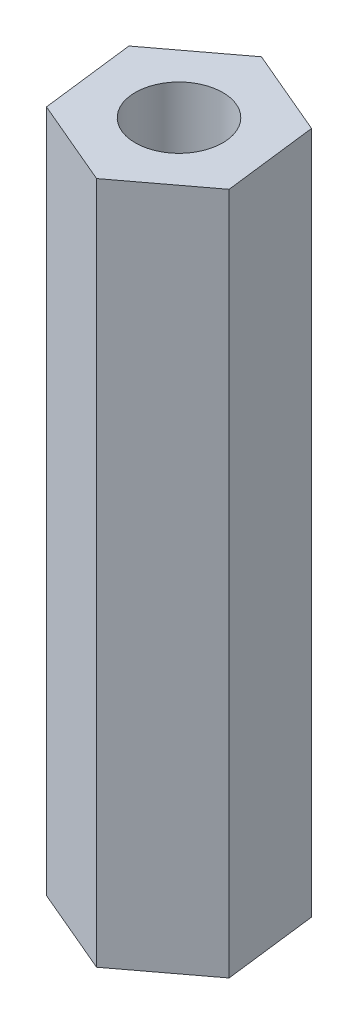
ISO-10303-21;
HEADER;
FILE_DESCRIPTION(('STEP AP214'),'2;1');
FILE_NAME('part.step','',(''),(''),'','','');
FILE_SCHEMA(('AUTOMOTIVE_DESIGN { 1 0 10303 214 1 1 1 1 }'));
ENDSEC;
DATA;
#1=APPLICATION_CONTEXT('core data for automotive mechanical design processes');
#2=APPLICATION_PROTOCOL_DEFINITION('international standard','automotive_design',2000,#1);
#3=PRODUCT_CONTEXT('',#1,'mechanical');
#4=PRODUCT('Part','Part','',(#3));
#5=PRODUCT_RELATED_PRODUCT_CATEGORY('part','',(#4));
#6=PRODUCT_DEFINITION_FORMATION('','',#4);
#7=PRODUCT_DEFINITION_CONTEXT('part definition',#1,'design');
#8=PRODUCT_DEFINITION('design','',#6,#7);
#9=PRODUCT_DEFINITION_SHAPE('','',#8);
#10=(LENGTH_UNIT() NAMED_UNIT(*) SI_UNIT(.MILLI.,.METRE.));
#11=(NAMED_UNIT(*) PLANE_ANGLE_UNIT() SI_UNIT($,.RADIAN.));
#12=(NAMED_UNIT(*) SI_UNIT($,.STERADIAN.) SOLID_ANGLE_UNIT());
#13=UNCERTAINTY_MEASURE_WITH_UNIT(LENGTH_MEASURE(1.E-05),#10,'distance_accuracy_value','');
#14=(GEOMETRIC_REPRESENTATION_CONTEXT(3) GLOBAL_UNCERTAINTY_ASSIGNED_CONTEXT((#13)) GLOBAL_UNIT_ASSIGNED_CONTEXT((#10,
#11,#12)) REPRESENTATION_CONTEXT('',''));
#15=CARTESIAN_POINT('',(0.,0.,0.));
#16=DIRECTION('',(0.,0.,1.));
#17=DIRECTION('',(1.,0.,0.));
#18=AXIS2_PLACEMENT_3D('',#15,#16,#17);
#19=CARTESIAN_POINT('',(0.,25.,0.));
#20=DIRECTION('',(0.,1.,0.));
#21=DIRECTION('',(0.,0.,1.));
#22=AXIS2_PLACEMENT_3D('',#19,#20,#21);
#23=PLANE('',#22);
#24=DIRECTION('',(-0.121573231281397,0.,-0.992582464803706));
#25=VECTOR('',#24,1.);
#26=CARTESIAN_POINT('',(3.18831840783081,25.,1.35448356589777));
#27=LINE('',#26,#25);
#28=CARTESIAN_POINT('',(3.18831840783081,25.,1.35448356589777));
#29=VERTEX_POINT('',#28);
#30=CARTESIAN_POINT('',(2.76717638099141,25.,-2.08392295358615));
#31=VERTEX_POINT('',#30);
#32=EDGE_CURVE('E146',#29,#31,#27,.T.);
#33=ORIENTED_EDGE('',*,*,#32,.T.);
#34=DIRECTION('',(-0.920388245511681,0.,-0.391005725692002));
#35=VECTOR('',#34,1.);
#36=CARTESIAN_POINT('',(2.76717638099141,25.,-2.08392295358615));
#37=LINE('',#36,#35);
#38=CARTESIAN_POINT('',(-0.421142026839402,25.,-3.43840651948392));
#39=VERTEX_POINT('',#38);
#40=EDGE_CURVE('E93',#31,#39,#37,.T.);
#41=ORIENTED_EDGE('',*,*,#40,.T.);
#42=DIRECTION('',(-0.798815014230284,0.,0.601576739111704));
#43=VECTOR('',#42,1.);
#44=CARTESIAN_POINT('',(-0.421142026839402,25.,-3.43840651948392));
#45=LINE('',#44,#43);
#46=CARTESIAN_POINT('',(-3.18831840783081,25.,-1.35448356589777));
#47=VERTEX_POINT('',#46);
#48=EDGE_CURVE('E106',#39,#47,#45,.T.);
#49=ORIENTED_EDGE('',*,*,#48,.T.);
#50=DIRECTION('',(0.121573231281397,0.,0.992582464803706));
#51=VECTOR('',#50,1.);
#52=CARTESIAN_POINT('',(-3.18831840783081,25.,-1.35448356589777));
#53=LINE('',#52,#51);
#54=CARTESIAN_POINT('',(-2.76717638099141,25.,2.08392295358615));
#55=VERTEX_POINT('',#54);
#56=EDGE_CURVE('E100',#47,#55,#53,.T.);
#57=ORIENTED_EDGE('',*,*,#56,.T.);
#58=DIRECTION('',(0.920388245511681,0.,0.391005725692002));
#59=VECTOR('',#58,1.);
#60=CARTESIAN_POINT('',(-2.76717638099141,25.,2.08392295358615));
#61=LINE('',#60,#59);
#62=CARTESIAN_POINT('',(0.421142026839401,25.,3.43840651948392));
#63=VERTEX_POINT('',#62);
#64=EDGE_CURVE('E104',#55,#63,#61,.T.);
#65=ORIENTED_EDGE('',*,*,#64,.T.);
#66=DIRECTION('',(0.798815014230284,0.,-0.601576739111704));
#67=VECTOR('',#66,1.);
#68=CARTESIAN_POINT('',(0.421142026839401,25.,3.43840651948392));
#69=LINE('',#68,#67);
#70=EDGE_CURVE('E56',#63,#29,#69,.T.);
#71=ORIENTED_EDGE('',*,*,#70,.T.);
#72=EDGE_LOOP('',(#33,#41,#49,#57,#65,#71));
#73=FACE_BOUND('',#72,.T.);
#74=CARTESIAN_POINT('',(0.,25.,0.));
#75=DIRECTION('',(0.,1.,0.));
#76=DIRECTION('',(0.,0.,1.));
#77=AXIS2_PLACEMENT_3D('',#74,#75,#76);
#78=CIRCLE('',#77,1.6);
#79=CARTESIAN_POINT('',(0.,25.,1.6));
#80=VERTEX_POINT('',#79);
#81=EDGE_CURVE('E135',#80,#80,#78,.T.);
#82=ORIENTED_EDGE('',*,*,#81,.F.);
#83=EDGE_LOOP('',(#82));
#84=FACE_BOUND('',#83,.T.);
#85=ADVANCED_FACE('F38',(#73,#84),#23,.T.);
#86=CARTESIAN_POINT('',(0.,0.,0.));
#87=DIRECTION('',(0.,1.,0.));
#88=DIRECTION('',(0.,0.,1.));
#89=AXIS2_PLACEMENT_3D('',#86,#87,#88);
#90=PLANE('',#89);
#91=DIRECTION('',(-0.121573231281397,0.,-0.992582464803706));
#92=VECTOR('',#91,1.);
#93=CARTESIAN_POINT('',(3.18831840783081,0.,1.35448356589777));
#94=LINE('',#93,#92);
#95=CARTESIAN_POINT('',(3.18831840783081,0.,1.35448356589777));
#96=VERTEX_POINT('',#95);
#97=CARTESIAN_POINT('',(2.76717638099141,0.,-2.08392295358615));
#98=VERTEX_POINT('',#97);
#99=EDGE_CURVE('E130',#96,#98,#94,.T.);
#100=ORIENTED_EDGE('',*,*,#99,.F.);
#101=DIRECTION('',(0.798815014230284,0.,-0.601576739111704));
#102=VECTOR('',#101,1.);
#103=CARTESIAN_POINT('',(0.421142026839401,0.,3.43840651948392));
#104=LINE('',#103,#102);
#105=CARTESIAN_POINT('',(0.421142026839401,0.,3.43840651948392));
#106=VERTEX_POINT('',#105);
#107=EDGE_CURVE('E85',#106,#96,#104,.T.);
#108=ORIENTED_EDGE('',*,*,#107,.F.);
#109=DIRECTION('',(0.920388245511681,0.,0.391005725692002));
#110=VECTOR('',#109,1.);
#111=CARTESIAN_POINT('',(-2.76717638099141,0.,2.08392295358615));
#112=LINE('',#111,#110);
#113=CARTESIAN_POINT('',(-2.76717638099141,0.,2.08392295358615));
#114=VERTEX_POINT('',#113);
#115=EDGE_CURVE('E79',#114,#106,#112,.T.);
#116=ORIENTED_EDGE('',*,*,#115,.F.);
#117=DIRECTION('',(0.121573231281397,0.,0.992582464803706));
#118=VECTOR('',#117,1.);
#119=CARTESIAN_POINT('',(-3.18831840783081,0.,-1.35448356589777));
#120=LINE('',#119,#118);
#121=CARTESIAN_POINT('',(-3.18831840783081,0.,-1.35448356589777));
#122=VERTEX_POINT('',#121);
#123=EDGE_CURVE('E115',#122,#114,#120,.T.);
#124=ORIENTED_EDGE('',*,*,#123,.F.);
#125=DIRECTION('',(-0.798815014230284,0.,0.601576739111704));
#126=VECTOR('',#125,1.);
#127=CARTESIAN_POINT('',(-0.421142026839402,0.,-3.43840651948392));
#128=LINE('',#127,#126);
#129=CARTESIAN_POINT('',(-0.421142026839402,0.,-3.43840651948392));
#130=VERTEX_POINT('',#129);
#131=EDGE_CURVE('E138',#130,#122,#128,.T.);
#132=ORIENTED_EDGE('',*,*,#131,.F.);
#133=DIRECTION('',(-0.920388245511681,0.,-0.391005725692002));
#134=VECTOR('',#133,1.);
#135=CARTESIAN_POINT('',(2.76717638099141,0.,-2.08392295358615));
#136=LINE('',#135,#134);
#137=EDGE_CURVE('E134',#98,#130,#136,.T.);
#138=ORIENTED_EDGE('',*,*,#137,.F.);
#139=EDGE_LOOP('',(#100,#108,#116,#124,#132,#138));
#140=FACE_BOUND('',#139,.T.);
#141=CARTESIAN_POINT('',(0.,0.,0.));
#142=DIRECTION('',(0.,1.,0.));
#143=DIRECTION('',(0.,0.,1.));
#144=AXIS2_PLACEMENT_3D('',#141,#142,#143);
#145=CIRCLE('',#144,1.6);
#146=CARTESIAN_POINT('',(0.,0.,1.6));
#147=VERTEX_POINT('',#146);
#148=EDGE_CURVE('E251',#147,#147,#145,.T.);
#149=ORIENTED_EDGE('',*,*,#148,.T.);
#150=EDGE_LOOP('',(#149));
#151=FACE_BOUND('',#150,.T.);
#152=ADVANCED_FACE('F158',(#140,#151),#90,.F.);
#153=CARTESIAN_POINT('',(3.18831840783081,25.,1.35448356589777));
#154=DIRECTION('',(-0.992582464803706,0.,0.121573231281397));
#155=DIRECTION('',(0.121573231281397,0.,0.992582464803706));
#156=AXIS2_PLACEMENT_3D('',#153,#154,#155);
#157=PLANE('',#156);
#158=ORIENTED_EDGE('',*,*,#99,.T.);
#159=DIRECTION('',(0.,-1.,0.));
#160=VECTOR('',#159,1.);
#161=CARTESIAN_POINT('',(2.76717638099141,25.,-2.08392295358615));
#162=LINE('',#161,#160);
#163=EDGE_CURVE('E11',#31,#98,#162,.T.);
#164=ORIENTED_EDGE('',*,*,#163,.F.);
#165=ORIENTED_EDGE('',*,*,#32,.F.);
#166=DIRECTION('',(0.,-1.,0.));
#167=VECTOR('',#166,1.);
#168=CARTESIAN_POINT('',(3.18831840783081,25.,1.35448356589777));
#169=LINE('',#168,#167);
#170=EDGE_CURVE('E126',#29,#96,#169,.T.);
#171=ORIENTED_EDGE('',*,*,#170,.T.);
#172=EDGE_LOOP('',(#158,#164,#165,#171));
#173=FACE_BOUND('',#172,.T.);
#174=ADVANCED_FACE('F40',(#173),#157,.F.);
#175=CARTESIAN_POINT('',(2.76717638099141,25.,-2.08392295358615));
#176=DIRECTION('',(-0.391005725692002,0.,0.920388245511681));
#177=DIRECTION('',(0.920388245511681,0.,0.391005725692002));
#178=AXIS2_PLACEMENT_3D('',#175,#176,#177);
#179=PLANE('',#178);
#180=ORIENTED_EDGE('',*,*,#137,.T.);
#181=DIRECTION('',(0.,-1.,0.));
#182=VECTOR('',#181,1.);
#183=CARTESIAN_POINT('',(-0.421142026839402,25.,-3.43840651948392));
#184=LINE('',#183,#182);
#185=EDGE_CURVE('E48',#39,#130,#184,.T.);
#186=ORIENTED_EDGE('',*,*,#185,.F.);
#187=ORIENTED_EDGE('',*,*,#40,.F.);
#188=ORIENTED_EDGE('',*,*,#163,.T.);
#189=EDGE_LOOP('',(#180,#186,#187,#188));
#190=FACE_BOUND('',#189,.T.);
#191=ADVANCED_FACE('F183',(#190),#179,.F.);
#192=CARTESIAN_POINT('',(-0.421142026839402,25.,-3.43840651948392));
#193=DIRECTION('',(0.601576739111704,0.,0.798815014230284));
#194=DIRECTION('',(0.798815014230284,0.,-0.601576739111704));
#195=AXIS2_PLACEMENT_3D('',#192,#193,#194);
#196=PLANE('',#195);
#197=ORIENTED_EDGE('',*,*,#131,.T.);
#198=DIRECTION('',(0.,-1.,0.));
#199=VECTOR('',#198,1.);
#200=CARTESIAN_POINT('',(-3.18831840783081,25.,-1.35448356589777));
#201=LINE('',#200,#199);
#202=EDGE_CURVE('E117',#47,#122,#201,.T.);
#203=ORIENTED_EDGE('',*,*,#202,.F.);
#204=ORIENTED_EDGE('',*,*,#48,.F.);
#205=ORIENTED_EDGE('',*,*,#185,.T.);
#206=EDGE_LOOP('',(#197,#203,#204,#205));
#207=FACE_BOUND('',#206,.T.);
#208=ADVANCED_FACE('F155',(#207),#196,.F.);
#209=CARTESIAN_POINT('',(-3.18831840783081,25.,-1.35448356589777));
#210=DIRECTION('',(0.992582464803706,0.,-0.121573231281397));
#211=DIRECTION('',(-0.121573231281397,0.,-0.992582464803706));
#212=AXIS2_PLACEMENT_3D('',#209,#210,#211);
#213=PLANE('',#212);
#214=ORIENTED_EDGE('',*,*,#123,.T.);
#215=DIRECTION('',(0.,-1.,0.));
#216=VECTOR('',#215,1.);
#217=CARTESIAN_POINT('',(-2.76717638099141,25.,2.08392295358615));
#218=LINE('',#217,#216);
#219=EDGE_CURVE('E112',#55,#114,#218,.T.);
#220=ORIENTED_EDGE('',*,*,#219,.F.);
#221=ORIENTED_EDGE('',*,*,#56,.F.);
#222=ORIENTED_EDGE('',*,*,#202,.T.);
#223=EDGE_LOOP('',(#214,#220,#221,#222));
#224=FACE_BOUND('',#223,.T.);
#225=ADVANCED_FACE('F113',(#224),#213,.F.);
#226=CARTESIAN_POINT('',(-2.76717638099141,25.,2.08392295358615));
#227=DIRECTION('',(0.391005725692002,0.,-0.920388245511681));
#228=DIRECTION('',(-0.920388245511681,0.,-0.391005725692002));
#229=AXIS2_PLACEMENT_3D('',#226,#227,#228);
#230=PLANE('',#229);
#231=ORIENTED_EDGE('',*,*,#115,.T.);
#232=DIRECTION('',(0.,-1.,0.));
#233=VECTOR('',#232,1.);
#234=CARTESIAN_POINT('',(0.421142026839401,25.,3.43840651948392));
#235=LINE('',#234,#233);
#236=EDGE_CURVE('E118',#63,#106,#235,.T.);
#237=ORIENTED_EDGE('',*,*,#236,.F.);
#238=ORIENTED_EDGE('',*,*,#64,.F.);
#239=ORIENTED_EDGE('',*,*,#219,.T.);
#240=EDGE_LOOP('',(#231,#237,#238,#239));
#241=FACE_BOUND('',#240,.T.);
#242=ADVANCED_FACE('F120',(#241),#230,.F.);
#243=CARTESIAN_POINT('',(0.421142026839401,25.,3.43840651948392));
#244=DIRECTION('',(-0.601576739111704,0.,-0.798815014230284));
#245=DIRECTION('',(-0.798815014230284,0.,0.601576739111704));
#246=AXIS2_PLACEMENT_3D('',#243,#244,#245);
#247=PLANE('',#246);
#248=ORIENTED_EDGE('',*,*,#107,.T.);
#249=ORIENTED_EDGE('',*,*,#170,.F.);
#250=ORIENTED_EDGE('',*,*,#70,.F.);
#251=ORIENTED_EDGE('',*,*,#236,.T.);
#252=EDGE_LOOP('',(#248,#249,#250,#251));
#253=FACE_BOUND('',#252,.T.);
#254=ADVANCED_FACE('F163',(#253),#247,.F.);
#255=CARTESIAN_POINT('',(0.,25.,0.));
#256=DIRECTION('',(0.,-1.,0.));
#257=DIRECTION('',(0.,0.,-1.));
#258=AXIS2_PLACEMENT_3D('',#255,#256,#257);
#259=CYLINDRICAL_SURFACE('',#258,1.6);
#260=ORIENTED_EDGE('',*,*,#81,.T.);
#261=EDGE_LOOP('',(#260));
#262=FACE_BOUND('',#261,.T.);
#263=ORIENTED_EDGE('',*,*,#148,.F.);
#264=EDGE_LOOP('',(#263));
#265=FACE_BOUND('',#264,.T.);
#266=ADVANCED_FACE('F165',(#262,#265),#259,.F.);
#267=CLOSED_SHELL('',(#85,#152,#174,#191,#208,#225,#242,#254,#266));
#268=MANIFOLD_SOLID_BREP('B2',#267);
#269=ADVANCED_BREP_SHAPE_REPRESENTATION('',(#18,#268),#14);
#270=SHAPE_DEFINITION_REPRESENTATION(#9,#269);
ENDSEC;
END-ISO-10303-21;
